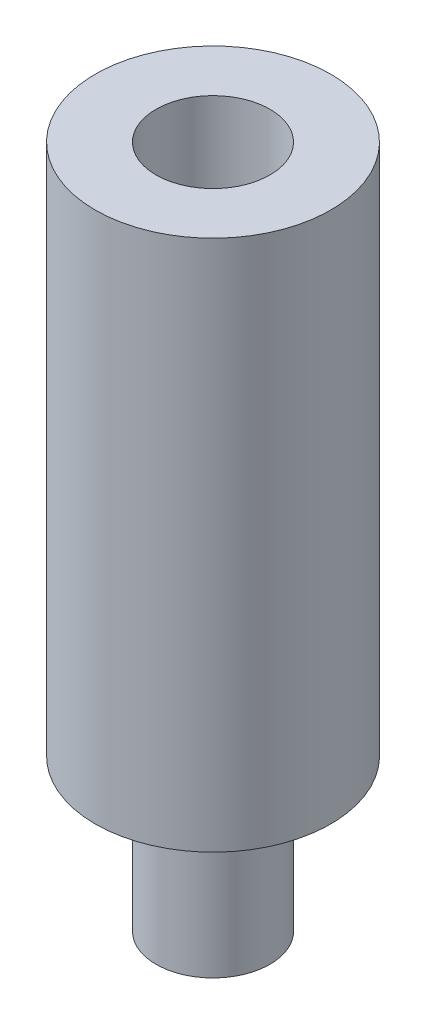
ISO-10303-21;
HEADER;
FILE_DESCRIPTION(('STEP AP214'),'2;1');
FILE_NAME('part.step','',(''),(''),'','','');
FILE_SCHEMA(('AUTOMOTIVE_DESIGN { 1 0 10303 214 1 1 1 1 }'));
ENDSEC;
DATA;
#1=APPLICATION_CONTEXT('core data for automotive mechanical design processes');
#2=APPLICATION_PROTOCOL_DEFINITION('international standard','automotive_design',2000,#1);
#3=PRODUCT_CONTEXT('',#1,'mechanical');
#4=PRODUCT('Part','Part','',(#3));
#5=PRODUCT_RELATED_PRODUCT_CATEGORY('part','',(#4));
#6=PRODUCT_DEFINITION_FORMATION('','',#4);
#7=PRODUCT_DEFINITION_CONTEXT('part definition',#1,'design');
#8=PRODUCT_DEFINITION('design','',#6,#7);
#9=PRODUCT_DEFINITION_SHAPE('','',#8);
#10=(LENGTH_UNIT() NAMED_UNIT(*) SI_UNIT(.MILLI.,.METRE.));
#11=(NAMED_UNIT(*) PLANE_ANGLE_UNIT() SI_UNIT($,.RADIAN.));
#12=(NAMED_UNIT(*) SI_UNIT($,.STERADIAN.) SOLID_ANGLE_UNIT());
#13=UNCERTAINTY_MEASURE_WITH_UNIT(LENGTH_MEASURE(1.E-05),#10,'distance_accuracy_value','');
#14=(GEOMETRIC_REPRESENTATION_CONTEXT(3) GLOBAL_UNCERTAINTY_ASSIGNED_CONTEXT((#13)) GLOBAL_UNIT_ASSIGNED_CONTEXT((#10,
#11,#12)) REPRESENTATION_CONTEXT('',''));
#15=CARTESIAN_POINT('',(0.,0.,0.));
#16=DIRECTION('',(0.,0.,1.));
#17=DIRECTION('',(1.,0.,0.));
#18=AXIS2_PLACEMENT_3D('',#15,#16,#17);
#19=CARTESIAN_POINT('',(0.,14.,0.));
#20=DIRECTION('',(0.,-1.,0.));
#21=DIRECTION('',(0.,0.,-1.));
#22=AXIS2_PLACEMENT_3D('',#19,#20,#21);
#23=CYLINDRICAL_SURFACE('',#22,3.1);
#24=CARTESIAN_POINT('',(0.,14.,0.));
#25=DIRECTION('',(0.,1.,0.));
#26=DIRECTION('',(0.,0.,1.));
#27=AXIS2_PLACEMENT_3D('',#24,#25,#26);
#28=CIRCLE('',#27,3.1);
#29=CARTESIAN_POINT('',(0.,14.,3.1));
#30=VERTEX_POINT('',#29);
#31=EDGE_CURVE('E38',#30,#30,#28,.T.);
#32=ORIENTED_EDGE('',*,*,#31,.F.);
#33=EDGE_LOOP('',(#32));
#34=FACE_BOUND('',#33,.T.);
#35=CARTESIAN_POINT('',(0.,0.,0.));
#36=DIRECTION('',(0.,1.,0.));
#37=DIRECTION('',(0.,0.,1.));
#38=AXIS2_PLACEMENT_3D('',#35,#36,#37);
#39=CIRCLE('',#38,3.1);
#40=CARTESIAN_POINT('',(0.,0.,3.1));
#41=VERTEX_POINT('',#40);
#42=EDGE_CURVE('E34',#41,#41,#39,.T.);
#43=ORIENTED_EDGE('',*,*,#42,.T.);
#44=EDGE_LOOP('',(#43));
#45=FACE_BOUND('',#44,.T.);
#46=ADVANCED_FACE('F31',(#34,#45),#23,.T.);
#47=CARTESIAN_POINT('',(0.,14.,0.));
#48=DIRECTION('',(0.,1.,0.));
#49=DIRECTION('',(0.,0.,1.));
#50=AXIS2_PLACEMENT_3D('',#47,#48,#49);
#51=PLANE('',#50);
#52=CARTESIAN_POINT('',(0.,14.,0.));
#53=DIRECTION('',(0.,1.,0.));
#54=DIRECTION('',(0.,0.,1.));
#55=AXIS2_PLACEMENT_3D('',#52,#53,#54);
#56=CIRCLE('',#55,1.5);
#57=CARTESIAN_POINT('',(0.,14.,1.5));
#58=VERTEX_POINT('',#57);
#59=EDGE_CURVE('E49',#58,#58,#56,.T.);
#60=ORIENTED_EDGE('',*,*,#59,.F.);
#61=EDGE_LOOP('',(#60));
#62=FACE_BOUND('',#61,.T.);
#63=ORIENTED_EDGE('',*,*,#31,.T.);
#64=EDGE_LOOP('',(#63));
#65=FACE_BOUND('',#64,.T.);
#66=ADVANCED_FACE('F71',(#62,#65),#51,.T.);
#67=CARTESIAN_POINT('',(0.,0.,0.));
#68=DIRECTION('',(0.,1.,0.));
#69=DIRECTION('',(0.,0.,1.));
#70=AXIS2_PLACEMENT_3D('',#67,#68,#69);
#71=PLANE('',#70);
#72=CARTESIAN_POINT('',(0.,0.,0.));
#73=DIRECTION('',(0.,-1.,0.));
#74=DIRECTION('',(0.,0.,-1.));
#75=AXIS2_PLACEMENT_3D('',#72,#73,#74);
#76=CIRCLE('',#75,1.5);
#77=CARTESIAN_POINT('',(0.,0.,-1.5));
#78=VERTEX_POINT('',#77);
#79=EDGE_CURVE('E10',#78,#78,#76,.T.);
#80=ORIENTED_EDGE('',*,*,#79,.F.);
#81=EDGE_LOOP('',(#80));
#82=FACE_BOUND('',#81,.T.);
#83=ORIENTED_EDGE('',*,*,#42,.F.);
#84=EDGE_LOOP('',(#83));
#85=FACE_BOUND('',#84,.T.);
#86=ADVANCED_FACE('F76',(#82,#85),#71,.F.);
#87=CARTESIAN_POINT('',(0.,9.,0.));
#88=DIRECTION('',(0.,1.,0.));
#89=DIRECTION('',(0.,0.,1.));
#90=AXIS2_PLACEMENT_3D('',#87,#88,#89);
#91=CYLINDRICAL_SURFACE('',#90,1.5);
#92=CARTESIAN_POINT('',(0.,9.,0.));
#93=DIRECTION('',(0.,1.,0.));
#94=DIRECTION('',(0.,0.,1.));
#95=AXIS2_PLACEMENT_3D('',#92,#93,#94);
#96=CIRCLE('',#95,1.5);
#97=CARTESIAN_POINT('',(0.,9.,1.5));
#98=VERTEX_POINT('',#97);
#99=EDGE_CURVE('E46',#98,#98,#96,.T.);
#100=ORIENTED_EDGE('',*,*,#99,.F.);
#101=EDGE_LOOP('',(#100));
#102=FACE_BOUND('',#101,.T.);
#103=ORIENTED_EDGE('',*,*,#59,.T.);
#104=EDGE_LOOP('',(#103));
#105=FACE_BOUND('',#104,.T.);
#106=ADVANCED_FACE('F67',(#102,#105),#91,.F.);
#107=CARTESIAN_POINT('',(0.,9.,0.));
#108=DIRECTION('',(0.,1.,0.));
#109=DIRECTION('',(0.,0.,1.));
#110=AXIS2_PLACEMENT_3D('',#107,#108,#109);
#111=PLANE('',#110);
#112=ORIENTED_EDGE('',*,*,#99,.T.);
#113=EDGE_LOOP('',(#112));
#114=FACE_BOUND('',#113,.T.);
#115=ADVANCED_FACE('F60',(#114),#111,.T.);
#116=CARTESIAN_POINT('',(0.,-4.,0.));
#117=DIRECTION('',(0.,1.,0.));
#118=DIRECTION('',(0.,0.,1.));
#119=AXIS2_PLACEMENT_3D('',#116,#117,#118);
#120=CYLINDRICAL_SURFACE('',#119,1.5);
#121=CARTESIAN_POINT('',(0.,-4.,0.));
#122=DIRECTION('',(0.,-1.,0.));
#123=DIRECTION('',(0.,0.,-1.));
#124=AXIS2_PLACEMENT_3D('',#121,#122,#123);
#125=CIRCLE('',#124,1.5);
#126=CARTESIAN_POINT('',(0.,-4.,-1.5));
#127=VERTEX_POINT('',#126);
#128=EDGE_CURVE('E45',#127,#127,#125,.T.);
#129=ORIENTED_EDGE('',*,*,#128,.F.);
#130=EDGE_LOOP('',(#129));
#131=FACE_BOUND('',#130,.T.);
#132=ORIENTED_EDGE('',*,*,#79,.T.);
#133=EDGE_LOOP('',(#132));
#134=FACE_BOUND('',#133,.T.);
#135=ADVANCED_FACE('F58',(#131,#134),#120,.T.);
#136=CARTESIAN_POINT('',(0.,-4.,0.));
#137=DIRECTION('',(0.,-1.,0.));
#138=DIRECTION('',(0.,0.,-1.));
#139=AXIS2_PLACEMENT_3D('',#136,#137,#138);
#140=PLANE('',#139);
#141=ORIENTED_EDGE('',*,*,#128,.T.);
#142=EDGE_LOOP('',(#141));
#143=FACE_BOUND('',#142,.T.);
#144=ADVANCED_FACE('F56',(#143),#140,.T.);
#145=CLOSED_SHELL('',(#46,#66,#86,#106,#115,#135,#144));
#146=MANIFOLD_SOLID_BREP('B2',#145);
#147=ADVANCED_BREP_SHAPE_REPRESENTATION('',(#18,#146),#14);
#148=SHAPE_DEFINITION_REPRESENTATION(#9,#147);
ENDSEC;
END-ISO-10303-21;
